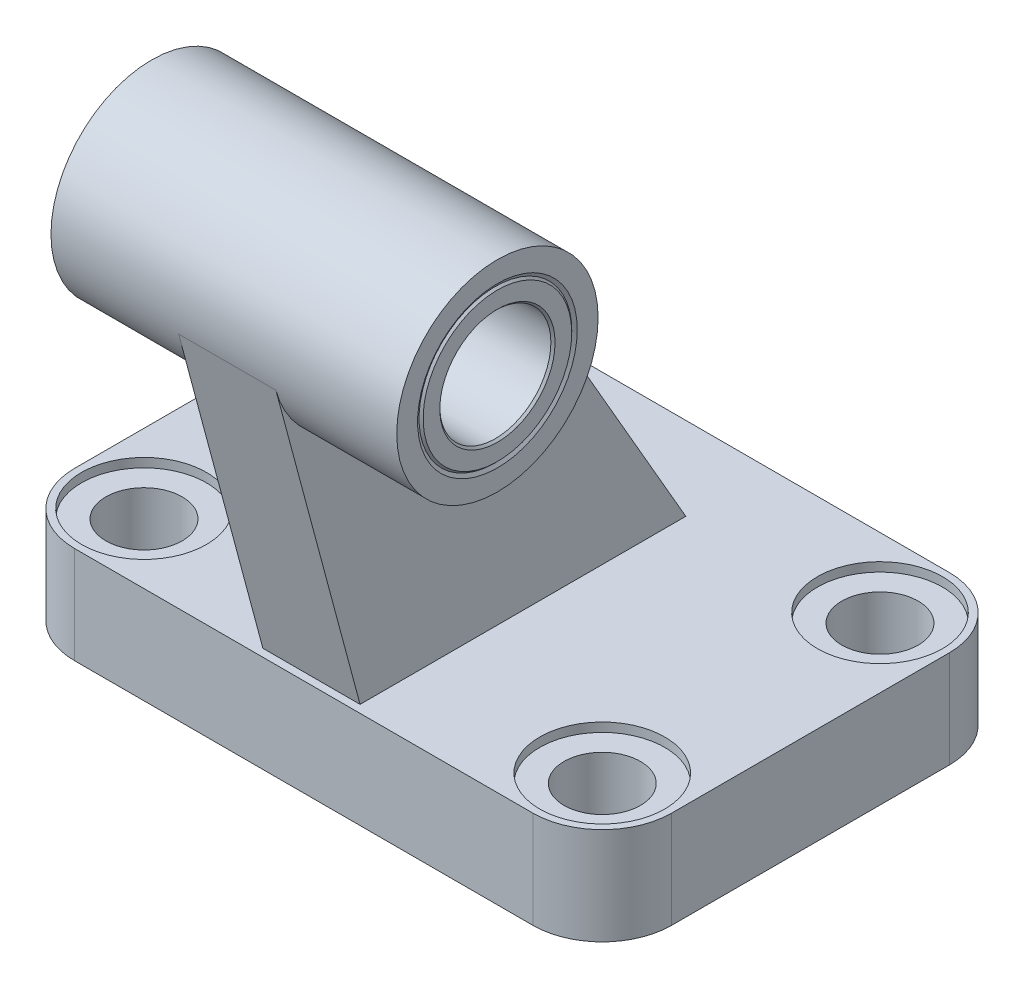
ISO-10303-21;
HEADER;
FILE_DESCRIPTION(('STEP AP214'),'2;1');
FILE_NAME('part.step','',(''),(''),'','','');
FILE_SCHEMA(('AUTOMOTIVE_DESIGN { 1 0 10303 214 1 1 1 1 }'));
ENDSEC;
DATA;
#1=APPLICATION_CONTEXT('core data for automotive mechanical design processes');
#2=APPLICATION_PROTOCOL_DEFINITION('international standard','automotive_design',2000,#1);
#3=PRODUCT_CONTEXT('',#1,'mechanical');
#4=PRODUCT('Part','Part','',(#3));
#5=PRODUCT_RELATED_PRODUCT_CATEGORY('part','',(#4));
#6=PRODUCT_DEFINITION_FORMATION('','',#4);
#7=PRODUCT_DEFINITION_CONTEXT('part definition',#1,'design');
#8=PRODUCT_DEFINITION('design','',#6,#7);
#9=PRODUCT_DEFINITION_SHAPE('','',#8);
#10=(LENGTH_UNIT() NAMED_UNIT(*) SI_UNIT(.MILLI.,.METRE.));
#11=(NAMED_UNIT(*) PLANE_ANGLE_UNIT() SI_UNIT($,.RADIAN.));
#12=(NAMED_UNIT(*) SI_UNIT($,.STERADIAN.) SOLID_ANGLE_UNIT());
#13=UNCERTAINTY_MEASURE_WITH_UNIT(LENGTH_MEASURE(1.E-05),#10,'distance_accuracy_value','');
#14=(GEOMETRIC_REPRESENTATION_CONTEXT(3) GLOBAL_UNCERTAINTY_ASSIGNED_CONTEXT((#13)) GLOBAL_UNIT_ASSIGNED_CONTEXT((#10,
#11,#12)) REPRESENTATION_CONTEXT('',''));
#15=CARTESIAN_POINT('',(0.,0.,0.));
#16=DIRECTION('',(0.,0.,1.));
#17=DIRECTION('',(1.,0.,0.));
#18=AXIS2_PLACEMENT_3D('',#15,#16,#17);
#19=CARTESIAN_POINT('',(24.9,63.,27.));
#20=DIRECTION('',(1.,0.,0.));
#21=DIRECTION('',(0.,0.,-1.));
#22=AXIS2_PLACEMENT_3D('',#19,#20,#21);
#23=CYLINDRICAL_SURFACE('',#22,11.);
#24=CARTESIAN_POINT('',(24.6,63.,27.));
#25=DIRECTION('',(1.,0.,0.));
#26=DIRECTION('',(0.,0.,-1.));
#27=AXIS2_PLACEMENT_3D('',#24,#25,#26);
#28=CIRCLE('',#27,11.);
#29=CARTESIAN_POINT('',(24.6,63.,16.));
#30=VERTEX_POINT('',#29);
#31=EDGE_CURVE('E304',#30,#30,#28,.T.);
#32=ORIENTED_EDGE('',*,*,#31,.F.);
#33=EDGE_LOOP('',(#32));
#34=FACE_BOUND('',#33,.T.);
#35=CARTESIAN_POINT('',(24.6113248654052,63.,27.));
#36=DIRECTION('',(1.,0.,0.));
#37=DIRECTION('',(0.,0.,-1.));
#38=AXIS2_PLACEMENT_3D('',#35,#36,#37);
#39=CIRCLE('',#38,11.);
#40=CARTESIAN_POINT('',(24.6113248654052,63.,16.));
#41=VERTEX_POINT('',#40);
#42=EDGE_CURVE('E283',#41,#41,#39,.T.);
#43=ORIENTED_EDGE('',*,*,#42,.T.);
#44=EDGE_LOOP('',(#43));
#45=FACE_BOUND('',#44,.T.);
#46=ADVANCED_FACE('F32',(#34,#45),#23,.F.);
#47=CARTESIAN_POINT('',(-33.0000000000001,14.,20.0000000000001));
#48=DIRECTION('',(0.,-1.,0.));
#49=DIRECTION('',(0.,0.,-1.));
#50=AXIS2_PLACEMENT_3D('',#47,#48,#49);
#51=CYLINDRICAL_SURFACE('',#50,9.9999999999999);
#52=CARTESIAN_POINT('',(-33.0000000000001,0.,20.0000000000001));
#53=DIRECTION('',(0.,1.,0.));
#54=DIRECTION('',(0.,0.,1.));
#55=AXIS2_PLACEMENT_3D('',#52,#53,#54);
#56=CIRCLE('',#55,9.9999999999999);
#57=CARTESIAN_POINT('',(-43.,0.,20.));
#58=VERTEX_POINT('',#57);
#59=CARTESIAN_POINT('',(-33.,0.,30.));
#60=VERTEX_POINT('',#59);
#61=EDGE_CURVE('E141',#58,#60,#56,.T.);
#62=ORIENTED_EDGE('',*,*,#61,.T.);
#63=DIRECTION('',(0.,-1.,0.));
#64=VECTOR('',#63,1.);
#65=CARTESIAN_POINT('',(-33.,14.,30.));
#66=LINE('',#65,#64);
#67=CARTESIAN_POINT('',(-33.,14.,30.));
#68=VERTEX_POINT('',#67);
#69=EDGE_CURVE('E40',#68,#60,#66,.T.);
#70=ORIENTED_EDGE('',*,*,#69,.F.);
#71=CARTESIAN_POINT('',(-33.0000000000001,14.,20.0000000000001));
#72=DIRECTION('',(0.,1.,0.));
#73=DIRECTION('',(0.,0.,1.));
#74=AXIS2_PLACEMENT_3D('',#71,#72,#73);
#75=CIRCLE('',#74,9.9999999999999);
#76=CARTESIAN_POINT('',(-43.,14.,20.));
#77=VERTEX_POINT('',#76);
#78=EDGE_CURVE('E157',#77,#68,#75,.T.);
#79=ORIENTED_EDGE('',*,*,#78,.F.);
#80=DIRECTION('',(0.,-1.,0.));
#81=VECTOR('',#80,1.);
#82=CARTESIAN_POINT('',(-43.,14.,20.));
#83=LINE('',#82,#81);
#84=EDGE_CURVE('E137',#77,#58,#83,.T.);
#85=ORIENTED_EDGE('',*,*,#84,.T.);
#86=EDGE_LOOP('',(#62,#70,#79,#85));
#87=FACE_BOUND('',#86,.T.);
#88=ADVANCED_FACE('F34',(#87),#51,.T.);
#89=CARTESIAN_POINT('',(-33.,14.,30.));
#90=DIRECTION('',(0.,0.,-1.));
#91=DIRECTION('',(-1.,0.,0.));
#92=AXIS2_PLACEMENT_3D('',#89,#90,#91);
#93=PLANE('',#92);
#94=DIRECTION('',(1.,0.,0.));
#95=VECTOR('',#94,1.);
#96=CARTESIAN_POINT('',(-33.,0.,30.));
#97=LINE('',#96,#95);
#98=CARTESIAN_POINT('',(33.,0.,30.));
#99=VERTEX_POINT('',#98);
#100=EDGE_CURVE('E144',#60,#99,#97,.T.);
#101=ORIENTED_EDGE('',*,*,#100,.T.);
#102=DIRECTION('',(0.,-1.,0.));
#103=VECTOR('',#102,1.);
#104=CARTESIAN_POINT('',(33.,14.,30.));
#105=LINE('',#104,#103);
#106=CARTESIAN_POINT('',(33.,14.,30.));
#107=VERTEX_POINT('',#106);
#108=EDGE_CURVE('E167',#107,#99,#105,.T.);
#109=ORIENTED_EDGE('',*,*,#108,.F.);
#110=DIRECTION('',(1.,0.,0.));
#111=VECTOR('',#110,1.);
#112=CARTESIAN_POINT('',(-33.,14.,30.));
#113=LINE('',#112,#111);
#114=EDGE_CURVE('E98',#68,#107,#113,.T.);
#115=ORIENTED_EDGE('',*,*,#114,.F.);
#116=ORIENTED_EDGE('',*,*,#69,.T.);
#117=EDGE_LOOP('',(#101,#109,#115,#116));
#118=FACE_BOUND('',#117,.T.);
#119=ADVANCED_FACE('F170',(#118),#93,.F.);
#120=CARTESIAN_POINT('',(33.0000000000001,14.,20.0000000000001));
#121=DIRECTION('',(0.,-1.,0.));
#122=DIRECTION('',(0.,0.,-1.));
#123=AXIS2_PLACEMENT_3D('',#120,#121,#122);
#124=CYLINDRICAL_SURFACE('',#123,9.9999999999999);
#125=CARTESIAN_POINT('',(33.0000000000001,0.,20.0000000000001));
#126=DIRECTION('',(0.,1.,0.));
#127=DIRECTION('',(0.,0.,1.));
#128=AXIS2_PLACEMENT_3D('',#125,#126,#127);
#129=CIRCLE('',#128,9.9999999999999);
#130=CARTESIAN_POINT('',(43.,0.,20.));
#131=VERTEX_POINT('',#130);
#132=EDGE_CURVE('E147',#99,#131,#129,.T.);
#133=ORIENTED_EDGE('',*,*,#132,.T.);
#134=DIRECTION('',(0.,-1.,0.));
#135=VECTOR('',#134,1.);
#136=CARTESIAN_POINT('',(43.,14.,20.));
#137=LINE('',#136,#135);
#138=CARTESIAN_POINT('',(43.,14.,20.));
#139=VERTEX_POINT('',#138);
#140=EDGE_CURVE('E164',#139,#131,#137,.T.);
#141=ORIENTED_EDGE('',*,*,#140,.F.);
#142=CARTESIAN_POINT('',(33.0000000000001,14.,20.0000000000001));
#143=DIRECTION('',(0.,1.,0.));
#144=DIRECTION('',(0.,0.,1.));
#145=AXIS2_PLACEMENT_3D('',#142,#143,#144);
#146=CIRCLE('',#145,9.9999999999999);
#147=EDGE_CURVE('E188',#107,#139,#146,.T.);
#148=ORIENTED_EDGE('',*,*,#147,.F.);
#149=ORIENTED_EDGE('',*,*,#108,.T.);
#150=EDGE_LOOP('',(#133,#141,#148,#149));
#151=FACE_BOUND('',#150,.T.);
#152=ADVANCED_FACE('F181',(#151),#124,.T.);
#153=CARTESIAN_POINT('',(43.,14.,20.));
#154=DIRECTION('',(-1.,0.,0.));
#155=DIRECTION('',(0.,0.,1.));
#156=AXIS2_PLACEMENT_3D('',#153,#154,#155);
#157=PLANE('',#156);
#158=DIRECTION('',(0.,0.,-1.));
#159=VECTOR('',#158,1.);
#160=CARTESIAN_POINT('',(43.,0.,20.));
#161=LINE('',#160,#159);
#162=CARTESIAN_POINT('',(43.,0.,-20.));
#163=VERTEX_POINT('',#162);
#164=EDGE_CURVE('E149',#131,#163,#161,.T.);
#165=ORIENTED_EDGE('',*,*,#164,.T.);
#166=DIRECTION('',(0.,-1.,0.));
#167=VECTOR('',#166,1.);
#168=CARTESIAN_POINT('',(43.,14.,-20.));
#169=LINE('',#168,#167);
#170=CARTESIAN_POINT('',(43.,14.,-20.));
#171=VERTEX_POINT('',#170);
#172=EDGE_CURVE('E161',#171,#163,#169,.T.);
#173=ORIENTED_EDGE('',*,*,#172,.F.);
#174=DIRECTION('',(0.,0.,-1.));
#175=VECTOR('',#174,1.);
#176=CARTESIAN_POINT('',(43.,14.,20.));
#177=LINE('',#176,#175);
#178=EDGE_CURVE('E187',#139,#171,#177,.T.);
#179=ORIENTED_EDGE('',*,*,#178,.F.);
#180=ORIENTED_EDGE('',*,*,#140,.T.);
#181=EDGE_LOOP('',(#165,#173,#179,#180));
#182=FACE_BOUND('',#181,.T.);
#183=ADVANCED_FACE('F185',(#182),#157,.F.);
#184=CARTESIAN_POINT('',(33.0000000000001,14.,-20.0000000000001));
#185=DIRECTION('',(0.,-1.,0.));
#186=DIRECTION('',(0.,0.,-1.));
#187=AXIS2_PLACEMENT_3D('',#184,#185,#186);
#188=CYLINDRICAL_SURFACE('',#187,9.9999999999999);
#189=CARTESIAN_POINT('',(33.0000000000001,0.,-20.0000000000001));
#190=DIRECTION('',(0.,1.,0.));
#191=DIRECTION('',(0.,0.,1.));
#192=AXIS2_PLACEMENT_3D('',#189,#190,#191);
#193=CIRCLE('',#192,9.9999999999999);
#194=CARTESIAN_POINT('',(33.,0.,-30.));
#195=VERTEX_POINT('',#194);
#196=EDGE_CURVE('E151',#163,#195,#193,.T.);
#197=ORIENTED_EDGE('',*,*,#196,.T.);
#198=DIRECTION('',(0.,-1.,0.));
#199=VECTOR('',#198,1.);
#200=CARTESIAN_POINT('',(33.,14.,-30.));
#201=LINE('',#200,#199);
#202=CARTESIAN_POINT('',(33.,14.,-30.));
#203=VERTEX_POINT('',#202);
#204=EDGE_CURVE('E132',#203,#195,#201,.T.);
#205=ORIENTED_EDGE('',*,*,#204,.F.);
#206=CARTESIAN_POINT('',(33.0000000000001,14.,-20.0000000000001));
#207=DIRECTION('',(0.,1.,0.));
#208=DIRECTION('',(0.,0.,1.));
#209=AXIS2_PLACEMENT_3D('',#206,#207,#208);
#210=CIRCLE('',#209,9.9999999999999);
#211=EDGE_CURVE('E120',#171,#203,#210,.T.);
#212=ORIENTED_EDGE('',*,*,#211,.F.);
#213=ORIENTED_EDGE('',*,*,#172,.T.);
#214=EDGE_LOOP('',(#197,#205,#212,#213));
#215=FACE_BOUND('',#214,.T.);
#216=ADVANCED_FACE('F641',(#215),#188,.T.);
#217=CARTESIAN_POINT('',(33.,14.,-30.));
#218=DIRECTION('',(0.,0.,1.));
#219=DIRECTION('',(1.,0.,0.));
#220=AXIS2_PLACEMENT_3D('',#217,#218,#219);
#221=PLANE('',#220);
#222=DIRECTION('',(-1.,0.,0.));
#223=VECTOR('',#222,1.);
#224=CARTESIAN_POINT('',(33.,0.,-30.));
#225=LINE('',#224,#223);
#226=CARTESIAN_POINT('',(-33.,0.,-30.));
#227=VERTEX_POINT('',#226);
#228=EDGE_CURVE('E129',#195,#227,#225,.T.);
#229=ORIENTED_EDGE('',*,*,#228,.T.);
#230=DIRECTION('',(0.,-1.,0.));
#231=VECTOR('',#230,1.);
#232=CARTESIAN_POINT('',(-33.,14.,-30.));
#233=LINE('',#232,#231);
#234=CARTESIAN_POINT('',(-33.,14.,-30.));
#235=VERTEX_POINT('',#234);
#236=EDGE_CURVE('E126',#235,#227,#233,.T.);
#237=ORIENTED_EDGE('',*,*,#236,.F.);
#238=DIRECTION('',(-1.,0.,0.));
#239=VECTOR('',#238,1.);
#240=CARTESIAN_POINT('',(33.,14.,-30.));
#241=LINE('',#240,#239);
#242=EDGE_CURVE('E113',#203,#235,#241,.T.);
#243=ORIENTED_EDGE('',*,*,#242,.F.);
#244=ORIENTED_EDGE('',*,*,#204,.T.);
#245=EDGE_LOOP('',(#229,#237,#243,#244));
#246=FACE_BOUND('',#245,.T.);
#247=ADVANCED_FACE('F127',(#246),#221,.F.);
#248=CARTESIAN_POINT('',(-33.0000000000001,14.,-20.0000000000001));
#249=DIRECTION('',(0.,-1.,0.));
#250=DIRECTION('',(0.,0.,-1.));
#251=AXIS2_PLACEMENT_3D('',#248,#249,#250);
#252=CYLINDRICAL_SURFACE('',#251,9.9999999999999);
#253=CARTESIAN_POINT('',(-33.0000000000001,0.,-20.0000000000001));
#254=DIRECTION('',(0.,1.,0.));
#255=DIRECTION('',(0.,0.,1.));
#256=AXIS2_PLACEMENT_3D('',#253,#254,#255);
#257=CIRCLE('',#256,9.9999999999999);
#258=CARTESIAN_POINT('',(-43.,0.,-20.));
#259=VERTEX_POINT('',#258);
#260=EDGE_CURVE('E154',#227,#259,#257,.T.);
#261=ORIENTED_EDGE('',*,*,#260,.T.);
#262=DIRECTION('',(0.,-1.,0.));
#263=VECTOR('',#262,1.);
#264=CARTESIAN_POINT('',(-43.,14.,-20.));
#265=LINE('',#264,#263);
#266=CARTESIAN_POINT('',(-43.,14.,-20.));
#267=VERTEX_POINT('',#266);
#268=EDGE_CURVE('E133',#267,#259,#265,.T.);
#269=ORIENTED_EDGE('',*,*,#268,.F.);
#270=CARTESIAN_POINT('',(-33.0000000000001,14.,-20.0000000000001));
#271=DIRECTION('',(0.,1.,0.));
#272=DIRECTION('',(0.,0.,1.));
#273=AXIS2_PLACEMENT_3D('',#270,#271,#272);
#274=CIRCLE('',#273,9.9999999999999);
#275=EDGE_CURVE('E117',#235,#267,#274,.T.);
#276=ORIENTED_EDGE('',*,*,#275,.F.);
#277=ORIENTED_EDGE('',*,*,#236,.T.);
#278=EDGE_LOOP('',(#261,#269,#276,#277));
#279=FACE_BOUND('',#278,.T.);
#280=ADVANCED_FACE('F135',(#279),#252,.T.);
#281=CARTESIAN_POINT('',(-43.,14.,-20.));
#282=DIRECTION('',(1.,0.,0.));
#283=DIRECTION('',(0.,0.,-1.));
#284=AXIS2_PLACEMENT_3D('',#281,#282,#283);
#285=PLANE('',#284);
#286=DIRECTION('',(0.,0.,1.));
#287=VECTOR('',#286,1.);
#288=CARTESIAN_POINT('',(-43.,0.,-20.));
#289=LINE('',#288,#287);
#290=EDGE_CURVE('E89',#259,#58,#289,.T.);
#291=ORIENTED_EDGE('',*,*,#290,.T.);
#292=ORIENTED_EDGE('',*,*,#84,.F.);
#293=DIRECTION('',(0.,0.,1.));
#294=VECTOR('',#293,1.);
#295=CARTESIAN_POINT('',(-43.,14.,-20.));
#296=LINE('',#295,#294);
#297=EDGE_CURVE('E56',#267,#77,#296,.T.);
#298=ORIENTED_EDGE('',*,*,#297,.F.);
#299=ORIENTED_EDGE('',*,*,#268,.T.);
#300=EDGE_LOOP('',(#291,#292,#298,#299));
#301=FACE_BOUND('',#300,.T.);
#302=ADVANCED_FACE('F619',(#301),#285,.F.);
#303=CARTESIAN_POINT('',(-33.0000000000001,14.,20.0000000000001));
#304=DIRECTION('',(0.,1.,0.));
#305=DIRECTION('',(0.,0.,1.));
#306=AXIS2_PLACEMENT_3D('',#303,#304,#305);
#307=PLANE('',#306);
#308=CARTESIAN_POINT('',(33.,14.,-20.));
#309=DIRECTION('',(0.,1.,0.));
#310=DIRECTION('',(0.,0.,1.));
#311=AXIS2_PLACEMENT_3D('',#308,#309,#310);
#312=CIRCLE('',#311,9.);
#313=CARTESIAN_POINT('',(33.,14.,-11.));
#314=VERTEX_POINT('',#313);
#315=EDGE_CURVE('E274',#314,#314,#312,.T.);
#316=ORIENTED_EDGE('',*,*,#315,.F.);
#317=EDGE_LOOP('',(#316));
#318=FACE_BOUND('',#317,.T.);
#319=CARTESIAN_POINT('',(33.,14.,20.));
#320=DIRECTION('',(0.,1.,0.));
#321=DIRECTION('',(0.,0.,1.));
#322=AXIS2_PLACEMENT_3D('',#319,#320,#321);
#323=CIRCLE('',#322,9.);
#324=CARTESIAN_POINT('',(33.,14.,29.));
#325=VERTEX_POINT('',#324);
#326=EDGE_CURVE('E262',#325,#325,#323,.T.);
#327=ORIENTED_EDGE('',*,*,#326,.F.);
#328=EDGE_LOOP('',(#327));
#329=FACE_BOUND('',#328,.T.);
#330=CARTESIAN_POINT('',(-33.,14.,-20.));
#331=DIRECTION('',(0.,1.,0.));
#332=DIRECTION('',(0.,0.,1.));
#333=AXIS2_PLACEMENT_3D('',#330,#331,#332);
#334=CIRCLE('',#333,9.);
#335=CARTESIAN_POINT('',(-33.,14.,-11.));
#336=VERTEX_POINT('',#335);
#337=EDGE_CURVE('E250',#336,#336,#334,.T.);
#338=ORIENTED_EDGE('',*,*,#337,.F.);
#339=EDGE_LOOP('',(#338));
#340=FACE_BOUND('',#339,.T.);
#341=CARTESIAN_POINT('',(-33.,14.,20.));
#342=DIRECTION('',(0.,1.,0.));
#343=DIRECTION('',(0.,0.,1.));
#344=AXIS2_PLACEMENT_3D('',#341,#342,#343);
#345=CIRCLE('',#344,9.);
#346=CARTESIAN_POINT('',(-33.,14.,29.));
#347=VERTEX_POINT('',#346);
#348=EDGE_CURVE('E238',#347,#347,#345,.T.);
#349=ORIENTED_EDGE('',*,*,#348,.F.);
#350=EDGE_LOOP('',(#349));
#351=FACE_BOUND('',#350,.T.);
#352=DIRECTION('',(0.,0.,-1.));
#353=VECTOR('',#352,1.);
#354=CARTESIAN_POINT('',(7.,14.,28.8819941868212));
#355=LINE('',#354,#353);
#356=CARTESIAN_POINT('',(7.,14.,28.8819941868212));
#357=VERTEX_POINT('',#356);
#358=CARTESIAN_POINT('',(7.,14.,-18.0333209967908));
#359=VERTEX_POINT('',#358);
#360=EDGE_CURVE('E207',#357,#359,#355,.T.);
#361=ORIENTED_EDGE('',*,*,#360,.F.);
#362=DIRECTION('',(-1.,0.,0.));
#363=VECTOR('',#362,1.);
#364=CARTESIAN_POINT('',(7.,14.,28.8819941868212));
#365=LINE('',#364,#363);
#366=CARTESIAN_POINT('',(-7.,14.,28.8819941868212));
#367=VERTEX_POINT('',#366);
#368=EDGE_CURVE('E196',#357,#367,#365,.T.);
#369=ORIENTED_EDGE('',*,*,#368,.T.);
#370=DIRECTION('',(0.,0.,-1.));
#371=VECTOR('',#370,1.);
#372=CARTESIAN_POINT('',(-7.,14.,28.8819941868212));
#373=LINE('',#372,#371);
#374=CARTESIAN_POINT('',(-7.,14.,-18.0333209967908));
#375=VERTEX_POINT('',#374);
#376=EDGE_CURVE('E214',#367,#375,#373,.T.);
#377=ORIENTED_EDGE('',*,*,#376,.T.);
#378=DIRECTION('',(-1.,0.,0.));
#379=VECTOR('',#378,1.);
#380=CARTESIAN_POINT('',(7.,14.,-18.0333209967908));
#381=LINE('',#380,#379);
#382=EDGE_CURVE('E199',#359,#375,#381,.T.);
#383=ORIENTED_EDGE('',*,*,#382,.F.);
#384=EDGE_LOOP('',(#361,#369,#377,#383));
#385=FACE_BOUND('',#384,.T.);
#386=ORIENTED_EDGE('',*,*,#78,.T.);
#387=ORIENTED_EDGE('',*,*,#114,.T.);
#388=ORIENTED_EDGE('',*,*,#147,.T.);
#389=ORIENTED_EDGE('',*,*,#178,.T.);
#390=ORIENTED_EDGE('',*,*,#211,.T.);
#391=ORIENTED_EDGE('',*,*,#242,.T.);
#392=ORIENTED_EDGE('',*,*,#275,.T.);
#393=ORIENTED_EDGE('',*,*,#297,.T.);
#394=EDGE_LOOP('',(#386,#387,#388,#389,#390,#391,#392,#393));
#395=FACE_BOUND('',#394,.T.);
#396=ADVANCED_FACE('F115',(#318,#329,#340,#351,#385,#395),#307,.T.);
#397=CARTESIAN_POINT('',(-33.0000000000001,0.,20.0000000000001));
#398=DIRECTION('',(0.,1.,0.));
#399=DIRECTION('',(0.,0.,1.));
#400=AXIS2_PLACEMENT_3D('',#397,#398,#399);
#401=PLANE('',#400);
#402=CARTESIAN_POINT('',(33.,0.,-20.));
#403=DIRECTION('',(0.,1.,0.));
#404=DIRECTION('',(0.,0.,1.));
#405=AXIS2_PLACEMENT_3D('',#402,#403,#404);
#406=CIRCLE('',#405,5.5);
#407=CARTESIAN_POINT('',(33.,0.,-14.5));
#408=VERTEX_POINT('',#407);
#409=EDGE_CURVE('E265',#408,#408,#406,.T.);
#410=ORIENTED_EDGE('',*,*,#409,.T.);
#411=EDGE_LOOP('',(#410));
#412=FACE_BOUND('',#411,.T.);
#413=CARTESIAN_POINT('',(33.,0.,20.));
#414=DIRECTION('',(0.,1.,0.));
#415=DIRECTION('',(0.,0.,1.));
#416=AXIS2_PLACEMENT_3D('',#413,#414,#415);
#417=CIRCLE('',#416,5.5);
#418=CARTESIAN_POINT('',(33.,0.,25.5));
#419=VERTEX_POINT('',#418);
#420=EDGE_CURVE('E253',#419,#419,#417,.T.);
#421=ORIENTED_EDGE('',*,*,#420,.T.);
#422=EDGE_LOOP('',(#421));
#423=FACE_BOUND('',#422,.T.);
#424=CARTESIAN_POINT('',(-33.,0.,-20.));
#425=DIRECTION('',(0.,1.,0.));
#426=DIRECTION('',(0.,0.,1.));
#427=AXIS2_PLACEMENT_3D('',#424,#425,#426);
#428=CIRCLE('',#427,5.5);
#429=CARTESIAN_POINT('',(-33.,0.,-14.5));
#430=VERTEX_POINT('',#429);
#431=EDGE_CURVE('E241',#430,#430,#428,.T.);
#432=ORIENTED_EDGE('',*,*,#431,.T.);
#433=EDGE_LOOP('',(#432));
#434=FACE_BOUND('',#433,.T.);
#435=CARTESIAN_POINT('',(-33.,0.,20.));
#436=DIRECTION('',(0.,1.,0.));
#437=DIRECTION('',(0.,0.,1.));
#438=AXIS2_PLACEMENT_3D('',#435,#436,#437);
#439=CIRCLE('',#438,5.5);
#440=CARTESIAN_POINT('',(-33.,0.,25.5));
#441=VERTEX_POINT('',#440);
#442=EDGE_CURVE('E229',#441,#441,#439,.T.);
#443=ORIENTED_EDGE('',*,*,#442,.T.);
#444=EDGE_LOOP('',(#443));
#445=FACE_BOUND('',#444,.T.);
#446=ORIENTED_EDGE('',*,*,#61,.F.);
#447=ORIENTED_EDGE('',*,*,#290,.F.);
#448=ORIENTED_EDGE('',*,*,#260,.F.);
#449=ORIENTED_EDGE('',*,*,#228,.F.);
#450=ORIENTED_EDGE('',*,*,#196,.F.);
#451=ORIENTED_EDGE('',*,*,#164,.F.);
#452=ORIENTED_EDGE('',*,*,#132,.F.);
#453=ORIENTED_EDGE('',*,*,#100,.F.);
#454=EDGE_LOOP('',(#446,#447,#448,#449,#450,#451,#452,#453));
#455=FACE_BOUND('',#454,.T.);
#456=ADVANCED_FACE('F175',(#412,#423,#434,#445,#455),#401,.F.);
#457=CARTESIAN_POINT('',(7.,59.2471238460134,41.0059244811915));
#458=DIRECTION('',(0.,0.258819045102521,-0.965925826289068));
#459=DIRECTION('',(0.,0.965925826289068,0.258819045102521));
#460=AXIS2_PLACEMENT_3D('',#457,#458,#459);
#461=PLANE('',#460);
#462=DIRECTION('',(-1.,0.,0.));
#463=VECTOR('',#462,1.);
#464=CARTESIAN_POINT('',(7.,59.2471238460134,41.0059244811915));
#465=LINE('',#464,#463);
#466=CARTESIAN_POINT('',(7.,59.2471238460134,41.0059244811915));
#467=VERTEX_POINT('',#466);
#468=CARTESIAN_POINT('',(-7.,59.2471238460134,41.0059244811915));
#469=VERTEX_POINT('',#468);
#470=EDGE_CURVE('E145',#467,#469,#465,.T.);
#471=ORIENTED_EDGE('',*,*,#470,.T.);
#472=DIRECTION('',(0.,-0.965925826289068,-0.258819045102521));
#473=VECTOR('',#472,1.);
#474=CARTESIAN_POINT('',(-7.,59.2471238460134,41.0059244811915));
#475=LINE('',#474,#473);
#476=EDGE_CURVE('E217',#469,#367,#475,.T.);
#477=ORIENTED_EDGE('',*,*,#476,.T.);
#478=ORIENTED_EDGE('',*,*,#368,.F.);
#479=DIRECTION('',(0.,-0.965925826289068,-0.258819045102521));
#480=VECTOR('',#479,1.);
#481=CARTESIAN_POINT('',(7.,59.2471238460134,41.0059244811915));
#482=LINE('',#481,#480);
#483=EDGE_CURVE('E210',#467,#357,#482,.T.);
#484=ORIENTED_EDGE('',*,*,#483,.F.);
#485=EDGE_LOOP('',(#471,#477,#478,#484));
#486=FACE_BOUND('',#485,.T.);
#487=ADVANCED_FACE('F595',(#486),#461,.F.);
#488=CARTESIAN_POINT('',(7.,14.,-18.0333209967908));
#489=DIRECTION('',(0.,-0.499999999999999,0.866025403784439));
#490=DIRECTION('',(0.,-0.866025403784439,-0.499999999999999));
#491=AXIS2_PLACEMENT_3D('',#488,#489,#490);
#492=PLANE('',#491);
#493=ORIENTED_EDGE('',*,*,#382,.T.);
#494=DIRECTION('',(0.,0.866025403784439,0.499999999999999));
#495=VECTOR('',#494,1.);
#496=CARTESIAN_POINT('',(-7.,14.,-18.0333209967908));
#497=LINE('',#496,#495);
#498=CARTESIAN_POINT('',(-7.,70.25,14.4426316451256));
#499=VERTEX_POINT('',#498);
#500=EDGE_CURVE('E47',#375,#499,#497,.T.);
#501=ORIENTED_EDGE('',*,*,#500,.T.);
#502=DIRECTION('',(-1.,0.,0.));
#503=VECTOR('',#502,1.);
#504=CARTESIAN_POINT('',(7.,70.25,14.4426316451256));
#505=LINE('',#504,#503);
#506=CARTESIAN_POINT('',(7.,70.25,14.4426316451256));
#507=VERTEX_POINT('',#506);
#508=EDGE_CURVE('E201',#507,#499,#505,.T.);
#509=ORIENTED_EDGE('',*,*,#508,.F.);
#510=DIRECTION('',(0.,0.866025403784439,0.499999999999999));
#511=VECTOR('',#510,1.);
#512=CARTESIAN_POINT('',(7.,14.,-18.0333209967908));
#513=LINE('',#512,#511);
#514=EDGE_CURVE('E204',#359,#507,#513,.T.);
#515=ORIENTED_EDGE('',*,*,#514,.F.);
#516=EDGE_LOOP('',(#493,#501,#509,#515));
#517=FACE_BOUND('',#516,.T.);
#518=ADVANCED_FACE('F586',(#517),#492,.F.);
#519=CARTESIAN_POINT('',(7.,0.,0.));
#520=DIRECTION('',(1.,0.,0.));
#521=DIRECTION('',(0.,0.,-1.));
#522=AXIS2_PLACEMENT_3D('',#519,#520,#521);
#523=PLANE('',#522);
#524=ORIENTED_EDGE('',*,*,#514,.T.);
#525=CARTESIAN_POINT('',(7.,63.,27.));
#526=DIRECTION('',(1.,0.,0.));
#527=DIRECTION('',(0.,0.,-1.));
#528=AXIS2_PLACEMENT_3D('',#525,#526,#527);
#529=CIRCLE('',#528,14.5);
#530=EDGE_CURVE('E220',#507,#467,#529,.F.);
#531=ORIENTED_EDGE('',*,*,#530,.T.);
#532=ORIENTED_EDGE('',*,*,#483,.T.);
#533=ORIENTED_EDGE('',*,*,#360,.T.);
#534=EDGE_LOOP('',(#524,#531,#532,#533));
#535=FACE_BOUND('',#534,.T.);
#536=ADVANCED_FACE('F578',(#535),#523,.T.);
#537=CARTESIAN_POINT('',(-7.,0.,0.));
#538=DIRECTION('',(1.,0.,0.));
#539=DIRECTION('',(0.,0.,-1.));
#540=AXIS2_PLACEMENT_3D('',#537,#538,#539);
#541=PLANE('',#540);
#542=CARTESIAN_POINT('',(-7.,63.,27.));
#543=DIRECTION('',(1.,0.,0.));
#544=DIRECTION('',(0.,0.,-1.));
#545=AXIS2_PLACEMENT_3D('',#542,#543,#544);
#546=CIRCLE('',#545,14.5);
#547=EDGE_CURVE('E11',#499,#469,#546,.F.);
#548=ORIENTED_EDGE('',*,*,#547,.F.);
#549=ORIENTED_EDGE('',*,*,#500,.F.);
#550=ORIENTED_EDGE('',*,*,#376,.F.);
#551=ORIENTED_EDGE('',*,*,#476,.F.);
#552=EDGE_LOOP('',(#548,#549,#550,#551));
#553=FACE_BOUND('',#552,.T.);
#554=ADVANCED_FACE('F569',(#553),#541,.F.);
#555=CARTESIAN_POINT('',(24.9,63.,27.));
#556=DIRECTION('',(-1.,0.,0.));
#557=DIRECTION('',(0.,0.,1.));
#558=AXIS2_PLACEMENT_3D('',#555,#556,#557);
#559=CYLINDRICAL_SURFACE('',#558,14.5);
#560=ORIENTED_EDGE('',*,*,#530,.F.);
#561=ORIENTED_EDGE('',*,*,#508,.T.);
#562=ORIENTED_EDGE('',*,*,#547,.T.);
#563=ORIENTED_EDGE('',*,*,#470,.F.);
#564=EDGE_LOOP('',(#560,#561,#562,#563));
#565=FACE_BOUND('',#564,.T.);
#566=CARTESIAN_POINT('',(24.9,63.,27.));
#567=DIRECTION('',(1.,0.,0.));
#568=DIRECTION('',(0.,0.,-1.));
#569=AXIS2_PLACEMENT_3D('',#566,#567,#568);
#570=CIRCLE('',#569,14.5);
#571=CARTESIAN_POINT('',(24.9,63.,12.5));
#572=VERTEX_POINT('',#571);
#573=EDGE_CURVE('E223',#572,#572,#570,.T.);
#574=ORIENTED_EDGE('',*,*,#573,.F.);
#575=EDGE_LOOP('',(#574));
#576=FACE_BOUND('',#575,.T.);
#577=CARTESIAN_POINT('',(-24.9,63.,27.));
#578=DIRECTION('',(1.,0.,0.));
#579=DIRECTION('',(0.,0.,-1.));
#580=AXIS2_PLACEMENT_3D('',#577,#578,#579);
#581=CIRCLE('',#580,14.5);
#582=CARTESIAN_POINT('',(-24.9,63.,12.5));
#583=VERTEX_POINT('',#582);
#584=EDGE_CURVE('E226',#583,#583,#581,.T.);
#585=ORIENTED_EDGE('',*,*,#584,.T.);
#586=EDGE_LOOP('',(#585));
#587=FACE_BOUND('',#586,.T.);
#588=ADVANCED_FACE('F561',(#565,#576,#587),#559,.T.);
#589=CARTESIAN_POINT('',(24.9,63.,27.));
#590=DIRECTION('',(1.,0.,0.));
#591=DIRECTION('',(0.,0.,-1.));
#592=AXIS2_PLACEMENT_3D('',#589,#590,#591);
#593=PLANE('',#592);
#594=CARTESIAN_POINT('',(24.9,63.,27.));
#595=DIRECTION('',(1.,0.,0.));
#596=DIRECTION('',(0.,0.,-1.));
#597=AXIS2_PLACEMENT_3D('',#594,#595,#596);
#598=CIRCLE('',#597,11.5);
#599=CARTESIAN_POINT('',(24.9,63.,15.5));
#600=VERTEX_POINT('',#599);
#601=EDGE_CURVE('E286',#600,#600,#598,.T.);
#602=ORIENTED_EDGE('',*,*,#601,.F.);
#603=EDGE_LOOP('',(#602));
#604=FACE_BOUND('',#603,.T.);
#605=ORIENTED_EDGE('',*,*,#573,.T.);
#606=EDGE_LOOP('',(#605));
#607=FACE_BOUND('',#606,.T.);
#608=ADVANCED_FACE('F553',(#604,#607),#593,.T.);
#609=CARTESIAN_POINT('',(-24.9,63.,27.));
#610=DIRECTION('',(1.,0.,0.));
#611=DIRECTION('',(0.,0.,-1.));
#612=AXIS2_PLACEMENT_3D('',#609,#610,#611);
#613=PLANE('',#612);
#614=CARTESIAN_POINT('',(-24.9,63.,27.));
#615=DIRECTION('',(1.,0.,0.));
#616=DIRECTION('',(0.,0.,-1.));
#617=AXIS2_PLACEMENT_3D('',#614,#615,#616);
#618=CIRCLE('',#617,11.5);
#619=CARTESIAN_POINT('',(-24.9,63.,15.5));
#620=VERTEX_POINT('',#619);
#621=EDGE_CURVE('E277',#620,#620,#618,.T.);
#622=ORIENTED_EDGE('',*,*,#621,.T.);
#623=EDGE_LOOP('',(#622));
#624=FACE_BOUND('',#623,.T.);
#625=ORIENTED_EDGE('',*,*,#584,.F.);
#626=EDGE_LOOP('',(#625));
#627=FACE_BOUND('',#626,.T.);
#628=ADVANCED_FACE('F544',(#624,#627),#613,.F.);
#629=CARTESIAN_POINT('',(-33.,14.,20.));
#630=DIRECTION('',(0.,1.,0.));
#631=DIRECTION('',(0.,0.,1.));
#632=AXIS2_PLACEMENT_3D('',#629,#630,#631);
#633=CYLINDRICAL_SURFACE('',#632,5.5);
#634=ORIENTED_EDGE('',*,*,#442,.F.);
#635=EDGE_LOOP('',(#634));
#636=FACE_BOUND('',#635,.T.);
#637=CARTESIAN_POINT('',(-33.,12.7,20.));
#638=DIRECTION('',(0.,1.,0.));
#639=DIRECTION('',(0.,0.,1.));
#640=AXIS2_PLACEMENT_3D('',#637,#638,#639);
#641=CIRCLE('',#640,5.5);
#642=CARTESIAN_POINT('',(-33.,12.7,25.5));
#643=VERTEX_POINT('',#642);
#644=EDGE_CURVE('E232',#643,#643,#641,.T.);
#645=ORIENTED_EDGE('',*,*,#644,.T.);
#646=EDGE_LOOP('',(#645));
#647=FACE_BOUND('',#646,.T.);
#648=ADVANCED_FACE('F535',(#636,#647),#633,.F.);
#649=CARTESIAN_POINT('',(-38.5,12.7,20.));
#650=DIRECTION('',(0.,-1.,0.));
#651=DIRECTION('',(0.,0.,-1.));
#652=AXIS2_PLACEMENT_3D('',#649,#650,#651);
#653=PLANE('',#652);
#654=ORIENTED_EDGE('',*,*,#644,.F.);
#655=EDGE_LOOP('',(#654));
#656=FACE_BOUND('',#655,.T.);
#657=CARTESIAN_POINT('',(-33.,12.7,20.));
#658=DIRECTION('',(0.,1.,0.));
#659=DIRECTION('',(0.,0.,1.));
#660=AXIS2_PLACEMENT_3D('',#657,#658,#659);
#661=CIRCLE('',#660,9.);
#662=CARTESIAN_POINT('',(-33.,12.7,29.));
#663=VERTEX_POINT('',#662);
#664=EDGE_CURVE('E235',#663,#663,#661,.T.);
#665=ORIENTED_EDGE('',*,*,#664,.T.);
#666=EDGE_LOOP('',(#665));
#667=FACE_BOUND('',#666,.T.);
#668=ADVANCED_FACE('F526',(#656,#667),#653,.F.);
#669=CARTESIAN_POINT('',(-33.,14.,20.));
#670=DIRECTION('',(0.,1.,0.));
#671=DIRECTION('',(0.,0.,1.));
#672=AXIS2_PLACEMENT_3D('',#669,#670,#671);
#673=CYLINDRICAL_SURFACE('',#672,9.);
#674=ORIENTED_EDGE('',*,*,#664,.F.);
#675=EDGE_LOOP('',(#674));
#676=FACE_BOUND('',#675,.T.);
#677=ORIENTED_EDGE('',*,*,#348,.T.);
#678=EDGE_LOOP('',(#677));
#679=FACE_BOUND('',#678,.T.);
#680=ADVANCED_FACE('F517',(#676,#679),#673,.F.);
#681=CARTESIAN_POINT('',(-33.,14.,-20.));
#682=DIRECTION('',(0.,1.,0.));
#683=DIRECTION('',(0.,0.,1.));
#684=AXIS2_PLACEMENT_3D('',#681,#682,#683);
#685=CYLINDRICAL_SURFACE('',#684,5.5);
#686=ORIENTED_EDGE('',*,*,#431,.F.);
#687=EDGE_LOOP('',(#686));
#688=FACE_BOUND('',#687,.T.);
#689=CARTESIAN_POINT('',(-33.,12.7,-20.));
#690=DIRECTION('',(0.,1.,0.));
#691=DIRECTION('',(0.,0.,1.));
#692=AXIS2_PLACEMENT_3D('',#689,#690,#691);
#693=CIRCLE('',#692,5.5);
#694=CARTESIAN_POINT('',(-33.,12.7,-14.5));
#695=VERTEX_POINT('',#694);
#696=EDGE_CURVE('E244',#695,#695,#693,.T.);
#697=ORIENTED_EDGE('',*,*,#696,.T.);
#698=EDGE_LOOP('',(#697));
#699=FACE_BOUND('',#698,.T.);
#700=ADVANCED_FACE('F508',(#688,#699),#685,.F.);
#701=CARTESIAN_POINT('',(-38.5,12.7,-20.));
#702=DIRECTION('',(0.,-1.,0.));
#703=DIRECTION('',(0.,0.,-1.));
#704=AXIS2_PLACEMENT_3D('',#701,#702,#703);
#705=PLANE('',#704);
#706=ORIENTED_EDGE('',*,*,#696,.F.);
#707=EDGE_LOOP('',(#706));
#708=FACE_BOUND('',#707,.T.);
#709=CARTESIAN_POINT('',(-33.,12.7,-20.));
#710=DIRECTION('',(0.,1.,0.));
#711=DIRECTION('',(0.,0.,1.));
#712=AXIS2_PLACEMENT_3D('',#709,#710,#711);
#713=CIRCLE('',#712,9.);
#714=CARTESIAN_POINT('',(-33.,12.7,-11.));
#715=VERTEX_POINT('',#714);
#716=EDGE_CURVE('E247',#715,#715,#713,.T.);
#717=ORIENTED_EDGE('',*,*,#716,.T.);
#718=EDGE_LOOP('',(#717));
#719=FACE_BOUND('',#718,.T.);
#720=ADVANCED_FACE('F499',(#708,#719),#705,.F.);
#721=CARTESIAN_POINT('',(-33.,14.,-20.));
#722=DIRECTION('',(0.,1.,0.));
#723=DIRECTION('',(0.,0.,1.));
#724=AXIS2_PLACEMENT_3D('',#721,#722,#723);
#725=CYLINDRICAL_SURFACE('',#724,9.);
#726=ORIENTED_EDGE('',*,*,#716,.F.);
#727=EDGE_LOOP('',(#726));
#728=FACE_BOUND('',#727,.T.);
#729=ORIENTED_EDGE('',*,*,#337,.T.);
#730=EDGE_LOOP('',(#729));
#731=FACE_BOUND('',#730,.T.);
#732=ADVANCED_FACE('F490',(#728,#731),#725,.F.);
#733=CARTESIAN_POINT('',(33.,14.,20.));
#734=DIRECTION('',(0.,1.,0.));
#735=DIRECTION('',(0.,0.,1.));
#736=AXIS2_PLACEMENT_3D('',#733,#734,#735);
#737=CYLINDRICAL_SURFACE('',#736,5.5);
#738=ORIENTED_EDGE('',*,*,#420,.F.);
#739=EDGE_LOOP('',(#738));
#740=FACE_BOUND('',#739,.T.);
#741=CARTESIAN_POINT('',(33.,12.7,20.));
#742=DIRECTION('',(0.,1.,0.));
#743=DIRECTION('',(0.,0.,1.));
#744=AXIS2_PLACEMENT_3D('',#741,#742,#743);
#745=CIRCLE('',#744,5.5);
#746=CARTESIAN_POINT('',(33.,12.7,25.5));
#747=VERTEX_POINT('',#746);
#748=EDGE_CURVE('E256',#747,#747,#745,.T.);
#749=ORIENTED_EDGE('',*,*,#748,.T.);
#750=EDGE_LOOP('',(#749));
#751=FACE_BOUND('',#750,.T.);
#752=ADVANCED_FACE('F481',(#740,#751),#737,.F.);
#753=CARTESIAN_POINT('',(27.5,12.7,20.));
#754=DIRECTION('',(0.,-1.,0.));
#755=DIRECTION('',(0.,0.,-1.));
#756=AXIS2_PLACEMENT_3D('',#753,#754,#755);
#757=PLANE('',#756);
#758=ORIENTED_EDGE('',*,*,#748,.F.);
#759=EDGE_LOOP('',(#758));
#760=FACE_BOUND('',#759,.T.);
#761=CARTESIAN_POINT('',(33.,12.7,20.));
#762=DIRECTION('',(0.,1.,0.));
#763=DIRECTION('',(0.,0.,1.));
#764=AXIS2_PLACEMENT_3D('',#761,#762,#763);
#765=CIRCLE('',#764,9.);
#766=CARTESIAN_POINT('',(33.,12.7,29.));
#767=VERTEX_POINT('',#766);
#768=EDGE_CURVE('E259',#767,#767,#765,.T.);
#769=ORIENTED_EDGE('',*,*,#768,.T.);
#770=EDGE_LOOP('',(#769));
#771=FACE_BOUND('',#770,.T.);
#772=ADVANCED_FACE('F471',(#760,#771),#757,.F.);
#773=CARTESIAN_POINT('',(33.,14.,20.));
#774=DIRECTION('',(0.,1.,0.));
#775=DIRECTION('',(0.,0.,1.));
#776=AXIS2_PLACEMENT_3D('',#773,#774,#775);
#777=CYLINDRICAL_SURFACE('',#776,9.);
#778=ORIENTED_EDGE('',*,*,#768,.F.);
#779=EDGE_LOOP('',(#778));
#780=FACE_BOUND('',#779,.T.);
#781=ORIENTED_EDGE('',*,*,#326,.T.);
#782=EDGE_LOOP('',(#781));
#783=FACE_BOUND('',#782,.T.);
#784=ADVANCED_FACE('F461',(#780,#783),#777,.F.);
#785=CARTESIAN_POINT('',(33.,14.,-20.));
#786=DIRECTION('',(0.,1.,0.));
#787=DIRECTION('',(0.,0.,1.));
#788=AXIS2_PLACEMENT_3D('',#785,#786,#787);
#789=CYLINDRICAL_SURFACE('',#788,5.5);
#790=ORIENTED_EDGE('',*,*,#409,.F.);
#791=EDGE_LOOP('',(#790));
#792=FACE_BOUND('',#791,.T.);
#793=CARTESIAN_POINT('',(33.,12.7,-20.));
#794=DIRECTION('',(0.,1.,0.));
#795=DIRECTION('',(0.,0.,1.));
#796=AXIS2_PLACEMENT_3D('',#793,#794,#795);
#797=CIRCLE('',#796,5.5);
#798=CARTESIAN_POINT('',(33.,12.7,-14.5));
#799=VERTEX_POINT('',#798);
#800=EDGE_CURVE('E268',#799,#799,#797,.T.);
#801=ORIENTED_EDGE('',*,*,#800,.T.);
#802=EDGE_LOOP('',(#801));
#803=FACE_BOUND('',#802,.T.);
#804=ADVANCED_FACE('F452',(#792,#803),#789,.F.);
#805=CARTESIAN_POINT('',(27.5,12.7,-20.));
#806=DIRECTION('',(0.,-1.,0.));
#807=DIRECTION('',(0.,0.,-1.));
#808=AXIS2_PLACEMENT_3D('',#805,#806,#807);
#809=PLANE('',#808);
#810=ORIENTED_EDGE('',*,*,#800,.F.);
#811=EDGE_LOOP('',(#810));
#812=FACE_BOUND('',#811,.T.);
#813=CARTESIAN_POINT('',(33.,12.7,-20.));
#814=DIRECTION('',(0.,1.,0.));
#815=DIRECTION('',(0.,0.,1.));
#816=AXIS2_PLACEMENT_3D('',#813,#814,#815);
#817=CIRCLE('',#816,9.);
#818=CARTESIAN_POINT('',(33.,12.7,-11.));
#819=VERTEX_POINT('',#818);
#820=EDGE_CURVE('E271',#819,#819,#817,.T.);
#821=ORIENTED_EDGE('',*,*,#820,.T.);
#822=EDGE_LOOP('',(#821));
#823=FACE_BOUND('',#822,.T.);
#824=ADVANCED_FACE('F442',(#812,#823),#809,.F.);
#825=CARTESIAN_POINT('',(33.,14.,-20.));
#826=DIRECTION('',(0.,1.,0.));
#827=DIRECTION('',(0.,0.,1.));
#828=AXIS2_PLACEMENT_3D('',#825,#826,#827);
#829=CYLINDRICAL_SURFACE('',#828,9.);
#830=ORIENTED_EDGE('',*,*,#820,.F.);
#831=EDGE_LOOP('',(#830));
#832=FACE_BOUND('',#831,.T.);
#833=ORIENTED_EDGE('',*,*,#315,.T.);
#834=EDGE_LOOP('',(#833));
#835=FACE_BOUND('',#834,.T.);
#836=ADVANCED_FACE('F348',(#832,#835),#829,.F.);
#837=CARTESIAN_POINT('',(-24.6113248654052,63.,27.));
#838=DIRECTION('',(-1.,0.,0.));
#839=DIRECTION('',(0.,0.,1.));
#840=AXIS2_PLACEMENT_3D('',#837,#838,#839);
#841=CONICAL_SURFACE('',#840,11.,1.04719755119662);
#842=ORIENTED_EDGE('',*,*,#621,.F.);
#843=EDGE_LOOP('',(#842));
#844=FACE_BOUND('',#843,.T.);
#845=CARTESIAN_POINT('',(-24.6113248654052,63.,27.));
#846=DIRECTION('',(1.,0.,0.));
#847=DIRECTION('',(0.,0.,-1.));
#848=AXIS2_PLACEMENT_3D('',#845,#846,#847);
#849=CIRCLE('',#848,11.);
#850=CARTESIAN_POINT('',(-24.6113248654052,63.,16.));
#851=VERTEX_POINT('',#850);
#852=EDGE_CURVE('E280',#851,#851,#849,.T.);
#853=ORIENTED_EDGE('',*,*,#852,.T.);
#854=EDGE_LOOP('',(#853));
#855=FACE_BOUND('',#854,.T.);
#856=ADVANCED_FACE('F343',(#844,#855),#841,.F.);
#857=CARTESIAN_POINT('',(-24.6,63.,27.));
#858=DIRECTION('',(1.,0.,0.));
#859=DIRECTION('',(0.,0.,-1.));
#860=AXIS2_PLACEMENT_3D('',#857,#858,#859);
#861=CIRCLE('',#860,11.);
#862=CARTESIAN_POINT('',(-24.6,63.,16.));
#863=VERTEX_POINT('',#862);
#864=EDGE_CURVE('E307',#863,#863,#861,.T.);
#865=ORIENTED_EDGE('',*,*,#864,.T.);
#866=EDGE_LOOP('',(#865));
#867=FACE_BOUND('',#866,.T.);
#868=ORIENTED_EDGE('',*,*,#852,.F.);
#869=EDGE_LOOP('',(#868));
#870=FACE_BOUND('',#869,.T.);
#871=ADVANCED_FACE('F330',(#867,#870),#23,.F.);
#872=CARTESIAN_POINT('',(24.9,63.,27.));
#873=DIRECTION('',(1.,0.,0.));
#874=DIRECTION('',(0.,0.,-1.));
#875=AXIS2_PLACEMENT_3D('',#872,#873,#874);
#876=CONICAL_SURFACE('',#875,11.5,1.04719755119662);
#877=ORIENTED_EDGE('',*,*,#42,.F.);
#878=EDGE_LOOP('',(#877));
#879=FACE_BOUND('',#878,.T.);
#880=ORIENTED_EDGE('',*,*,#601,.T.);
#881=EDGE_LOOP('',(#880));
#882=FACE_BOUND('',#881,.T.);
#883=ADVANCED_FACE('F320',(#879,#882),#876,.F.);
#884=CARTESIAN_POINT('',(-24.9,73.7,27.));
#885=DIRECTION('',(-1.,0.,0.));
#886=DIRECTION('',(0.,0.,1.));
#887=AXIS2_PLACEMENT_3D('',#884,#885,#886);
#888=PLANE('',#887);
#889=CARTESIAN_POINT('',(-24.9,63.,27.));
#890=DIRECTION('',(1.,0.,0.));
#891=DIRECTION('',(0.,0.,-1.));
#892=AXIS2_PLACEMENT_3D('',#889,#890,#891);
#893=CIRCLE('',#892,8.3);
#894=CARTESIAN_POINT('',(-24.9,63.,18.7));
#895=VERTEX_POINT('',#894);
#896=EDGE_CURVE('E289',#895,#895,#893,.T.);
#897=ORIENTED_EDGE('',*,*,#896,.T.);
#898=EDGE_LOOP('',(#897));
#899=FACE_BOUND('',#898,.T.);
#900=CARTESIAN_POINT('',(-24.9,63.,27.));
#901=DIRECTION('',(1.,0.,0.));
#902=DIRECTION('',(0.,0.,-1.));
#903=AXIS2_PLACEMENT_3D('',#900,#901,#902);
#904=CIRCLE('',#903,10.7);
#905=CARTESIAN_POINT('',(-24.9,63.,16.3));
#906=VERTEX_POINT('',#905);
#907=EDGE_CURVE('E310',#906,#906,#904,.T.);
#908=ORIENTED_EDGE('',*,*,#907,.F.);
#909=EDGE_LOOP('',(#908));
#910=FACE_BOUND('',#909,.T.);
#911=ADVANCED_FACE('F317',(#899,#910),#888,.T.);
#912=CARTESIAN_POINT('',(-24.9,63.,27.));
#913=DIRECTION('',(-1.,0.,0.));
#914=DIRECTION('',(0.,0.,1.));
#915=AXIS2_PLACEMENT_3D('',#912,#913,#914);
#916=CONICAL_SURFACE('',#915,8.3,0.785398163397471);
#917=CARTESIAN_POINT('',(-24.6,63.,27.));
#918=DIRECTION('',(1.,0.,0.));
#919=DIRECTION('',(0.,0.,-1.));
#920=AXIS2_PLACEMENT_3D('',#917,#918,#919);
#921=CIRCLE('',#920,7.99999999999999);
#922=CARTESIAN_POINT('',(-24.6,63.,19.));
#923=VERTEX_POINT('',#922);
#924=EDGE_CURVE('E292',#923,#923,#921,.T.);
#925=ORIENTED_EDGE('',*,*,#924,.T.);
#926=EDGE_LOOP('',(#925));
#927=FACE_BOUND('',#926,.T.);
#928=ORIENTED_EDGE('',*,*,#896,.F.);
#929=EDGE_LOOP('',(#928));
#930=FACE_BOUND('',#929,.T.);
#931=ADVANCED_FACE('F319',(#927,#930),#916,.F.);
#932=CARTESIAN_POINT('',(24.9,63.,27.));
#933=DIRECTION('',(1.,0.,0.));
#934=DIRECTION('',(0.,0.,-1.));
#935=AXIS2_PLACEMENT_3D('',#932,#933,#934);
#936=CYLINDRICAL_SURFACE('',#935,7.99999999999999);
#937=CARTESIAN_POINT('',(24.6,63.,27.));
#938=DIRECTION('',(1.,0.,0.));
#939=DIRECTION('',(0.,0.,-1.));
#940=AXIS2_PLACEMENT_3D('',#937,#938,#939);
#941=CIRCLE('',#940,7.99999999999999);
#942=CARTESIAN_POINT('',(24.6,63.,19.));
#943=VERTEX_POINT('',#942);
#944=EDGE_CURVE('E295',#943,#943,#941,.T.);
#945=ORIENTED_EDGE('',*,*,#944,.T.);
#946=EDGE_LOOP('',(#945));
#947=FACE_BOUND('',#946,.T.);
#948=ORIENTED_EDGE('',*,*,#924,.F.);
#949=EDGE_LOOP('',(#948));
#950=FACE_BOUND('',#949,.T.);
#951=ADVANCED_FACE('F327',(#947,#950),#936,.F.);
#952=CARTESIAN_POINT('',(24.6,63.,27.));
#953=DIRECTION('',(1.,0.,0.));
#954=DIRECTION('',(0.,0.,-1.));
#955=AXIS2_PLACEMENT_3D('',#952,#953,#954);
#956=CONICAL_SURFACE('',#955,7.99999999999999,0.785398163397466);
#957=CARTESIAN_POINT('',(24.9,63.,27.));
#958=DIRECTION('',(1.,0.,0.));
#959=DIRECTION('',(0.,0.,-1.));
#960=AXIS2_PLACEMENT_3D('',#957,#958,#959);
#961=CIRCLE('',#960,8.3);
#962=CARTESIAN_POINT('',(24.9,63.,18.7));
#963=VERTEX_POINT('',#962);
#964=EDGE_CURVE('E298',#963,#963,#961,.T.);
#965=ORIENTED_EDGE('',*,*,#964,.T.);
#966=EDGE_LOOP('',(#965));
#967=FACE_BOUND('',#966,.T.);
#968=ORIENTED_EDGE('',*,*,#944,.F.);
#969=EDGE_LOOP('',(#968));
#970=FACE_BOUND('',#969,.T.);
#971=ADVANCED_FACE('F366',(#967,#970),#956,.F.);
#972=CARTESIAN_POINT('',(24.9,71.3,27.));
#973=DIRECTION('',(1.,0.,0.));
#974=DIRECTION('',(0.,0.,-1.));
#975=AXIS2_PLACEMENT_3D('',#972,#973,#974);
#976=PLANE('',#975);
#977=CARTESIAN_POINT('',(24.9,63.,27.));
#978=DIRECTION('',(1.,0.,0.));
#979=DIRECTION('',(0.,0.,-1.));
#980=AXIS2_PLACEMENT_3D('',#977,#978,#979);
#981=CIRCLE('',#980,10.7);
#982=CARTESIAN_POINT('',(24.9,63.,16.3));
#983=VERTEX_POINT('',#982);
#984=EDGE_CURVE('E301',#983,#983,#981,.T.);
#985=ORIENTED_EDGE('',*,*,#984,.T.);
#986=EDGE_LOOP('',(#985));
#987=FACE_BOUND('',#986,.T.);
#988=ORIENTED_EDGE('',*,*,#964,.F.);
#989=EDGE_LOOP('',(#988));
#990=FACE_BOUND('',#989,.T.);
#991=ADVANCED_FACE('F360',(#987,#990),#976,.T.);
#992=CARTESIAN_POINT('',(24.9,63.,27.));
#993=DIRECTION('',(-1.,0.,0.));
#994=DIRECTION('',(0.,0.,1.));
#995=AXIS2_PLACEMENT_3D('',#992,#993,#994);
#996=CONICAL_SURFACE('',#995,10.7,0.785398163397443);
#997=ORIENTED_EDGE('',*,*,#31,.T.);
#998=EDGE_LOOP('',(#997));
#999=FACE_BOUND('',#998,.T.);
#1000=ORIENTED_EDGE('',*,*,#984,.F.);
#1001=EDGE_LOOP('',(#1000));
#1002=FACE_BOUND('',#1001,.T.);
#1003=ADVANCED_FACE('F355',(#999,#1002),#996,.T.);
#1004=CARTESIAN_POINT('',(-24.6,63.,27.));
#1005=DIRECTION('',(1.,0.,0.));
#1006=DIRECTION('',(0.,0.,-1.));
#1007=AXIS2_PLACEMENT_3D('',#1004,#1005,#1006);
#1008=CONICAL_SURFACE('',#1007,11.,0.785398163397448);
#1009=ORIENTED_EDGE('',*,*,#907,.T.);
#1010=EDGE_LOOP('',(#1009));
#1011=FACE_BOUND('',#1010,.T.);
#1012=ORIENTED_EDGE('',*,*,#864,.F.);
#1013=EDGE_LOOP('',(#1012));
#1014=FACE_BOUND('',#1013,.T.);
#1015=ADVANCED_FACE('F314',(#1011,#1014),#1008,.T.);
#1016=CLOSED_SHELL('',(#46,#88,#119,#152,#183,#216,#247,#280,#302,#396,#456,#487,#518,#536,#554,
#588,#608,#628,#648,#668,#680,#700,#720,#732,#752,#772,#784,#804,#824,#836,#856,#871,#883,#911,
#931,#951,#971,#991,#1003,#1015));
#1017=MANIFOLD_SOLID_BREP('B2',#1016);
#1018=ADVANCED_BREP_SHAPE_REPRESENTATION('',(#18,#1017),#14);
#1019=SHAPE_DEFINITION_REPRESENTATION(#9,#1018);
ENDSEC;
END-ISO-10303-21;
